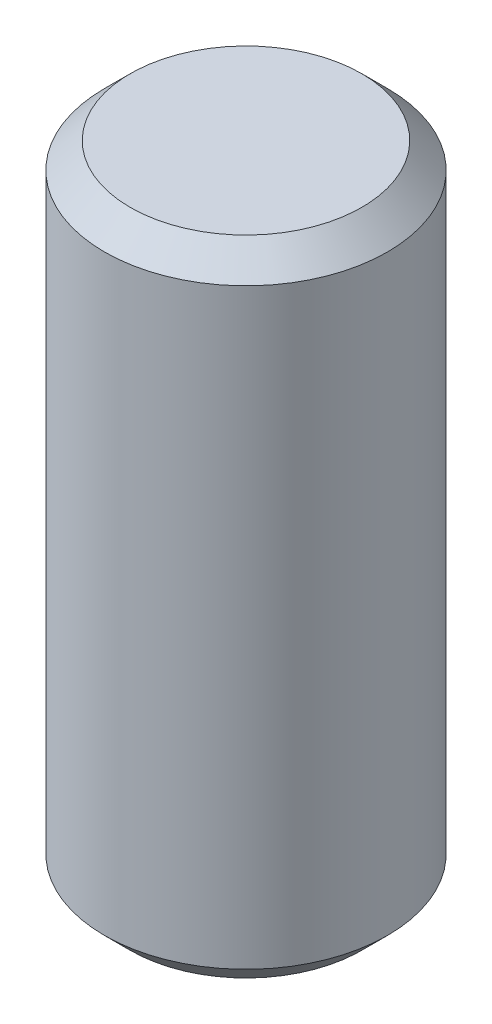
ISO-10303-21;
HEADER;
FILE_DESCRIPTION(('STEP AP214'),'2;1');
FILE_NAME('part.step','',(''),(''),'','','');
FILE_SCHEMA(('AUTOMOTIVE_DESIGN { 1 0 10303 214 1 1 1 1 }'));
ENDSEC;
DATA;
#1=APPLICATION_CONTEXT('core data for automotive mechanical design processes');
#2=APPLICATION_PROTOCOL_DEFINITION('international standard','automotive_design',2000,#1);
#3=PRODUCT_CONTEXT('',#1,'mechanical');
#4=PRODUCT('Part','Part','',(#3));
#5=PRODUCT_RELATED_PRODUCT_CATEGORY('part','',(#4));
#6=PRODUCT_DEFINITION_FORMATION('','',#4);
#7=PRODUCT_DEFINITION_CONTEXT('part definition',#1,'design');
#8=PRODUCT_DEFINITION('design','',#6,#7);
#9=PRODUCT_DEFINITION_SHAPE('','',#8);
#10=(LENGTH_UNIT() NAMED_UNIT(*) SI_UNIT(.MILLI.,.METRE.));
#11=(NAMED_UNIT(*) PLANE_ANGLE_UNIT() SI_UNIT($,.RADIAN.));
#12=(NAMED_UNIT(*) SI_UNIT($,.STERADIAN.) SOLID_ANGLE_UNIT());
#13=UNCERTAINTY_MEASURE_WITH_UNIT(LENGTH_MEASURE(1.E-05),#10,'distance_accuracy_value','');
#14=(GEOMETRIC_REPRESENTATION_CONTEXT(3) GLOBAL_UNCERTAINTY_ASSIGNED_CONTEXT((#13)) GLOBAL_UNIT_ASSIGNED_CONTEXT((#10,
#11,#12)) REPRESENTATION_CONTEXT('',''));
#15=CARTESIAN_POINT('',(0.,0.,0.));
#16=DIRECTION('',(0.,0.,1.));
#17=DIRECTION('',(1.,0.,0.));
#18=AXIS2_PLACEMENT_3D('',#15,#16,#17);
#19=CARTESIAN_POINT('',(0.,-6.35,0.));
#20=DIRECTION('',(0.,1.,0.));
#21=DIRECTION('',(0.,0.,1.));
#22=AXIS2_PLACEMENT_3D('',#19,#20,#21);
#23=PLANE('',#22);
#24=CARTESIAN_POINT('',(0.,-6.35,0.));
#25=DIRECTION('',(0.,1.,0.));
#26=DIRECTION('',(0.,0.,1.));
#27=AXIS2_PLACEMENT_3D('',#24,#25,#26);
#28=CIRCLE('',#27,2.286);
#29=CARTESIAN_POINT('',(0.,-6.35,2.286));
#30=VERTEX_POINT('',#29);
#31=EDGE_CURVE('E38',#30,#30,#28,.F.);
#32=ORIENTED_EDGE('',*,*,#31,.T.);
#33=EDGE_LOOP('',(#32));
#34=FACE_BOUND('',#33,.T.);
#35=ADVANCED_FACE('F31',(#34),#23,.F.);
#36=CARTESIAN_POINT('',(0.,6.08020788678209,0.));
#37=DIRECTION('',(0.,1.,0.));
#38=DIRECTION('',(0.,0.,1.));
#39=AXIS2_PLACEMENT_3D('',#36,#37,#38);
#40=CYLINDRICAL_SURFACE('',#39,2.794);
#41=CARTESIAN_POINT('',(0.,-5.842,0.));
#42=DIRECTION('',(0.,1.,0.));
#43=DIRECTION('',(0.,0.,1.));
#44=AXIS2_PLACEMENT_3D('',#41,#42,#43);
#45=CIRCLE('',#44,2.794);
#46=CARTESIAN_POINT('',(0.,-5.842,2.794));
#47=VERTEX_POINT('',#46);
#48=EDGE_CURVE('E42',#47,#47,#45,.T.);
#49=ORIENTED_EDGE('',*,*,#48,.T.);
#50=EDGE_LOOP('',(#49));
#51=FACE_BOUND('',#50,.T.);
#52=CARTESIAN_POINT('',(0.,5.842,0.));
#53=DIRECTION('',(0.,-1.,0.));
#54=DIRECTION('',(0.,0.,-1.));
#55=AXIS2_PLACEMENT_3D('',#52,#53,#54);
#56=CIRCLE('',#55,2.794);
#57=CARTESIAN_POINT('',(0.,5.842,-2.794));
#58=VERTEX_POINT('',#57);
#59=EDGE_CURVE('E46',#58,#58,#56,.T.);
#60=ORIENTED_EDGE('',*,*,#59,.T.);
#61=EDGE_LOOP('',(#60));
#62=FACE_BOUND('',#61,.T.);
#63=ADVANCED_FACE('F52',(#51,#62),#40,.T.);
#64=CARTESIAN_POINT('',(2.794,6.35,0.));
#65=DIRECTION('',(0.,-1.,0.));
#66=DIRECTION('',(0.,0.,-1.));
#67=AXIS2_PLACEMENT_3D('',#64,#65,#66);
#68=PLANE('',#67);
#69=CARTESIAN_POINT('',(0.,6.35,0.));
#70=DIRECTION('',(0.,-1.,0.));
#71=DIRECTION('',(0.,0.,-1.));
#72=AXIS2_PLACEMENT_3D('',#69,#70,#71);
#73=CIRCLE('',#72,2.286);
#74=CARTESIAN_POINT('',(0.,6.35,-2.286));
#75=VERTEX_POINT('',#74);
#76=EDGE_CURVE('E10',#75,#75,#73,.F.);
#77=ORIENTED_EDGE('',*,*,#76,.T.);
#78=EDGE_LOOP('',(#77));
#79=FACE_BOUND('',#78,.T.);
#80=ADVANCED_FACE('F60',(#79),#68,.F.);
#81=CARTESIAN_POINT('',(0.,-5.842,0.));
#82=DIRECTION('',(0.,1.,0.));
#83=DIRECTION('',(0.,0.,1.));
#84=AXIS2_PLACEMENT_3D('',#81,#82,#83);
#85=CONICAL_SURFACE('',#84,2.794,0.785398163397451);
#86=ORIENTED_EDGE('',*,*,#31,.F.);
#87=EDGE_LOOP('',(#86));
#88=FACE_BOUND('',#87,.T.);
#89=ORIENTED_EDGE('',*,*,#48,.F.);
#90=EDGE_LOOP('',(#89));
#91=FACE_BOUND('',#90,.T.);
#92=ADVANCED_FACE('F56',(#88,#91),#85,.T.);
#93=CARTESIAN_POINT('',(0.,6.35,0.));
#94=DIRECTION('',(0.,-1.,0.));
#95=DIRECTION('',(0.,0.,-1.));
#96=AXIS2_PLACEMENT_3D('',#93,#94,#95);
#97=CONICAL_SURFACE('',#96,2.286,0.785398163397445);
#98=ORIENTED_EDGE('',*,*,#59,.F.);
#99=EDGE_LOOP('',(#98));
#100=FACE_BOUND('',#99,.T.);
#101=ORIENTED_EDGE('',*,*,#76,.F.);
#102=EDGE_LOOP('',(#101));
#103=FACE_BOUND('',#102,.T.);
#104=ADVANCED_FACE('F33',(#100,#103),#97,.T.);
#105=CLOSED_SHELL('',(#35,#63,#80,#92,#104));
#106=MANIFOLD_SOLID_BREP('B2',#105);
#107=ADVANCED_BREP_SHAPE_REPRESENTATION('',(#18,#106),#14);
#108=SHAPE_DEFINITION_REPRESENTATION(#9,#107);
ENDSEC;
END-ISO-10303-21;
